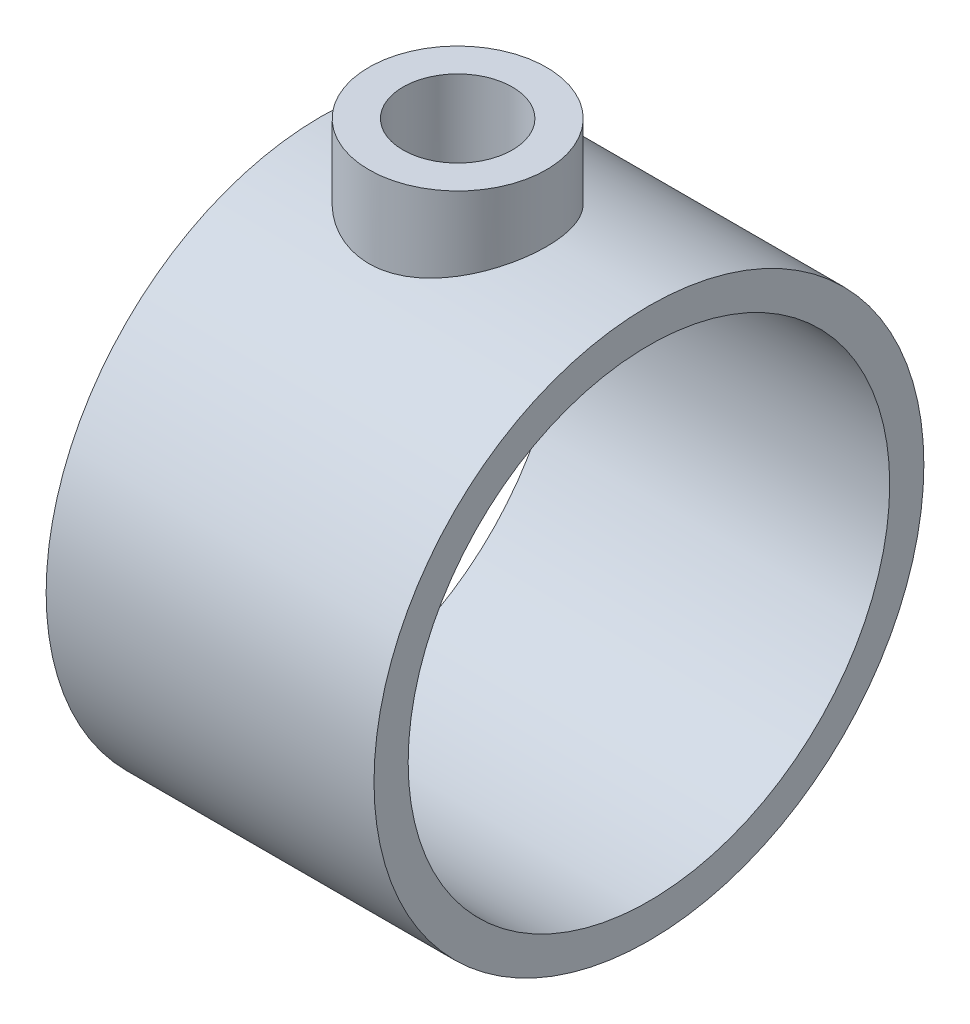
ISO-10303-21;
HEADER;
FILE_DESCRIPTION(('STEP AP214'),'2;1');
FILE_NAME('part.step','',(''),(''),'','','');
FILE_SCHEMA(('AUTOMOTIVE_DESIGN { 1 0 10303 214 1 1 1 1 }'));
ENDSEC;
DATA;
#1=APPLICATION_CONTEXT('core data for automotive mechanical design processes');
#2=APPLICATION_PROTOCOL_DEFINITION('international standard','automotive_design',2000,#1);
#3=PRODUCT_CONTEXT('',#1,'mechanical');
#4=PRODUCT('Part','Part','',(#3));
#5=PRODUCT_RELATED_PRODUCT_CATEGORY('part','',(#4));
#6=PRODUCT_DEFINITION_FORMATION('','',#4);
#7=PRODUCT_DEFINITION_CONTEXT('part definition',#1,'design');
#8=PRODUCT_DEFINITION('design','',#6,#7);
#9=PRODUCT_DEFINITION_SHAPE('','',#8);
#10=(LENGTH_UNIT() NAMED_UNIT(*) SI_UNIT(.MILLI.,.METRE.));
#11=(NAMED_UNIT(*) PLANE_ANGLE_UNIT() SI_UNIT($,.RADIAN.));
#12=(NAMED_UNIT(*) SI_UNIT($,.STERADIAN.) SOLID_ANGLE_UNIT());
#13=UNCERTAINTY_MEASURE_WITH_UNIT(LENGTH_MEASURE(1.E-05),#10,'distance_accuracy_value','');
#14=(GEOMETRIC_REPRESENTATION_CONTEXT(3) GLOBAL_UNCERTAINTY_ASSIGNED_CONTEXT((#13)) GLOBAL_UNIT_ASSIGNED_CONTEXT((#10,
#11,#12)) REPRESENTATION_CONTEXT('',''));
#15=CARTESIAN_POINT('',(0.,0.,0.));
#16=DIRECTION('',(0.,0.,1.));
#17=DIRECTION('',(1.,0.,0.));
#18=AXIS2_PLACEMENT_3D('',#15,#16,#17);
#19=CARTESIAN_POINT('',(3.38094128826442,4.025,0.));
#20=DIRECTION('',(1.,0.,0.));
#21=DIRECTION('',(0.,0.,-1.));
#22=AXIS2_PLACEMENT_3D('',#19,#20,#21);
#23=PLANE('',#22);
#24=CARTESIAN_POINT('',(3.38094128826442,0.,0.));
#25=DIRECTION('',(-1.,0.,0.));
#26=DIRECTION('',(0.,0.,1.));
#27=AXIS2_PLACEMENT_3D('',#24,#25,#26);
#28=CIRCLE('',#27,3.525);
#29=CARTESIAN_POINT('',(3.38094128826442,0.,3.525));
#30=VERTEX_POINT('',#29);
#31=EDGE_CURVE('E10',#30,#30,#28,.T.);
#32=ORIENTED_EDGE('',*,*,#31,.F.);
#33=EDGE_LOOP('',(#32));
#34=FACE_BOUND('',#33,.T.);
#35=CARTESIAN_POINT('',(3.38094128826442,0.,0.));
#36=DIRECTION('',(-1.,0.,0.));
#37=DIRECTION('',(0.,0.,1.));
#38=AXIS2_PLACEMENT_3D('',#35,#36,#37);
#39=CIRCLE('',#38,4.025);
#40=CARTESIAN_POINT('',(3.38094128826442,0.,4.025));
#41=VERTEX_POINT('',#40);
#42=EDGE_CURVE('E62',#41,#41,#39,.T.);
#43=ORIENTED_EDGE('',*,*,#42,.T.);
#44=EDGE_LOOP('',(#43));
#45=FACE_BOUND('',#44,.T.);
#46=ADVANCED_FACE('F36',(#34,#45),#23,.F.);
#47=CARTESIAN_POINT('',(0.,0.,0.));
#48=DIRECTION('',(-1.,0.,0.));
#49=DIRECTION('',(0.,0.,1.));
#50=AXIS2_PLACEMENT_3D('',#47,#48,#49);
#51=CYLINDRICAL_SURFACE('',#50,3.525);
#52=CARTESIAN_POINT('',(5.38094128826442,3.43301980769118,0.800000000000001));
#53=CARTESIAN_POINT('',(5.42525226088804,3.43302070048923,0.799998535829775));
#54=CARTESIAN_POINT('',(5.46958046197013,3.4338870608432,0.796305981011158));
#55=CARTESIAN_POINT('',(5.55697316237242,3.43725191148704,0.781651318657211));
#56=CARTESIAN_POINT('',(5.60003677190309,3.43975152350915,0.770684214816257));
#57=CARTESIAN_POINT('',(5.683623526805,3.44608553469889,0.741846119278411));
#58=CARTESIAN_POINT('',(5.72414952053777,3.44991840446084,0.723983035525875));
#59=CARTESIAN_POINT('',(5.80163126329277,3.45848520791049,0.681883077899317));
#60=CARTESIAN_POINT('',(5.83858702835545,3.46321913754959,0.657646232663392));
#61=CARTESIAN_POINT('',(5.90855115573315,3.47315082339766,0.603017045189949));
#62=CARTESIAN_POINT('',(5.94148516159075,3.47835489392696,0.572530604842659));
#63=CARTESIAN_POINT('',(6.00181871285318,3.48858534433158,0.506470654130731));
#64=CARTESIAN_POINT('',(6.02921780726854,3.49361170969984,0.470896729636411));
#65=CARTESIAN_POINT('',(6.0780004511039,3.50298946387944,0.395170329775834));
#66=CARTESIAN_POINT('',(6.0993120955657,3.50733253243985,0.35497041439999));
#67=CARTESIAN_POINT('',(6.13484910192897,3.51478284247769,0.271444513908556));
#68=CARTESIAN_POINT('',(6.14907532113002,3.51789023345651,0.228118907711874));
#69=CARTESIAN_POINT('',(6.16980269607263,3.5224744443327,0.140345179686971));
#70=CARTESIAN_POINT('',(6.17642981077126,3.52397782145897,0.0959282130728256));
#71=CARTESIAN_POINT('',(6.18216506865104,3.52527676171206,0.00658920940932185));
#72=CARTESIAN_POINT('',(6.18127413511958,3.52507253454887,-0.0383327649436317));
#73=CARTESIAN_POINT('',(6.17209159290147,3.52299944161139,-0.126536975405737));
#74=CARTESIAN_POINT('',(6.16393579787803,3.52116112577534,-0.169834174750001));
#75=CARTESIAN_POINT('',(6.14067193887226,3.51606140305558,-0.254428809790084));
#76=CARTESIAN_POINT('',(6.12556354521606,3.51279992868983,-0.295726150555252));
#77=CARTESIAN_POINT('',(6.08870583387539,3.50517181723292,-0.37552096879833));
#78=CARTESIAN_POINT('',(6.06690583192294,3.50079679052039,-0.413994200018452));
#79=CARTESIAN_POINT('',(6.01732167226206,3.49142003309992,-0.486785402591689));
#80=CARTESIAN_POINT('',(5.98953664147233,3.48641821100118,-0.521102766554873));
#81=CARTESIAN_POINT('',(5.92803449403406,3.47620454818785,-0.585416511171456));
#82=CARTESIAN_POINT('',(5.8941985373717,3.47099051248081,-0.615299004288452));
#83=CARTESIAN_POINT('',(5.82194137306676,3.4610443302105,-0.668987934320014));
#84=CARTESIAN_POINT('',(5.78352002113092,3.45631219882048,-0.692794179953165));
#85=CARTESIAN_POINT('',(5.70298884001895,3.44785923963272,-0.733710908704646));
#86=CARTESIAN_POINT('',(5.66086694231039,3.44414189640416,-0.750798407328598));
#87=CARTESIAN_POINT('',(5.57424481575524,3.43818662400077,-0.777617158550928));
#88=CARTESIAN_POINT('',(5.52974499780708,3.43594844011882,-0.787349677697718));
#89=CARTESIAN_POINT('',(5.44067477156119,3.43325724770042,-0.799002496436104));
#90=CARTESIAN_POINT('',(5.39612726545363,3.4327662058336,-0.801089265929088));
#91=CARTESIAN_POINT('',(5.30732086639102,3.43352206309775,-0.797843320428311));
#92=CARTESIAN_POINT('',(5.26306195220453,3.43476883289645,-0.792511157570018));
#93=CARTESIAN_POINT('',(5.17667825746427,3.43882378263148,-0.774723544233684));
#94=CARTESIAN_POINT('',(5.1345332832723,3.44161156716692,-0.76236107987514));
#95=CARTESIAN_POINT('',(5.05291303430534,3.44841579254659,-0.730965068193404));
#96=CARTESIAN_POINT('',(5.01343803142945,3.45243235829559,-0.71193084266157));
#97=CARTESIAN_POINT('',(4.93756163869414,3.46132426480786,-0.667369498490686));
#98=CARTESIAN_POINT('',(4.90122159238787,3.46621266223772,-0.64174058754597));
#99=CARTESIAN_POINT('',(4.83329692276114,3.47626361892882,-0.58484943585927));
#100=CARTESIAN_POINT('',(4.80171293860906,3.4814262149138,-0.553586439189094));
#101=CARTESIAN_POINT('',(4.74354376245764,3.49157013650939,-0.485558528212208));
#102=CARTESIAN_POINT('',(4.71707249110259,3.49654569033929,-0.448695192873638));
#103=CARTESIAN_POINT('',(4.67069797573317,3.50564568741497,-0.370948577328976));
#104=CARTESIAN_POINT('',(4.6507944132866,3.50977017192082,-0.330065492143305));
#105=CARTESIAN_POINT('',(4.6182754348628,3.51667913399352,-0.245703780043602));
#106=CARTESIAN_POINT('',(4.60561195024212,3.51947242852567,-0.202244437403343));
#107=CARTESIAN_POINT('',(4.58778371725046,3.52344253506629,-0.113744195948554));
#108=CARTESIAN_POINT('',(4.5826177904489,3.52461960110432,-0.0687035468163044));
#109=CARTESIAN_POINT('',(4.57998767849321,3.52521637204167,0.0206022435992021));
#110=CARTESIAN_POINT('',(4.58235392569866,3.52467476923431,0.0648622163104542));
#111=CARTESIAN_POINT('',(4.59433942486687,3.52197868344567,0.152336121374991));
#112=CARTESIAN_POINT('',(4.6039585265251,3.51982423388824,0.195550075386292));
#113=CARTESIAN_POINT('',(4.63009284597119,3.51414819826678,0.27956236981045));
#114=CARTESIAN_POINT('',(4.64658233106718,3.51063171705042,0.320369082069797));
#115=CARTESIAN_POINT('',(4.68596486896619,3.50260573930861,0.39865830378733));
#116=CARTESIAN_POINT('',(4.70885859347171,3.49809613863134,0.436140464009643));
#117=CARTESIAN_POINT('',(4.76094369695042,3.48846032847204,0.507538146439352));
#118=CARTESIAN_POINT('',(4.79025330433113,3.48332347470795,0.541365990143556));
#119=CARTESIAN_POINT('',(4.85410190058549,3.47306692745816,0.603680984366556));
#120=CARTESIAN_POINT('',(4.88864216177991,3.46794723845822,0.632166831697438));
#121=CARTESIAN_POINT('',(4.96258012830731,3.45822067212617,0.683393229037285));
#122=CARTESIAN_POINT('',(5.00204155202376,3.45362240110551,0.706043548160451));
#123=CARTESIAN_POINT('',(5.0843080134885,3.44556920752355,0.744354726662013));
#124=CARTESIAN_POINT('',(5.12711028479476,3.44211335112668,0.760021298382743));
#125=CARTESIAN_POINT('',(5.20509751666653,3.43735091216163,0.781237850557973));
#126=CARTESIAN_POINT('',(5.23987079966471,3.43573787556822,0.788259720605653));
#127=CARTESIAN_POINT('',(5.31007283579883,3.43357199629522,0.797641248962455));
#128=CARTESIAN_POINT('',(5.34550155173691,3.43301909363492,0.80000117103742));
#129=CARTESIAN_POINT('',(5.38094128826442,3.43301980769118,0.800000000000001));
#130=B_SPLINE_CURVE_WITH_KNOTS('',3,(#52,#53,#54,#55,#56,#57,#58,#59,#60,#61,#62,#63,#64,#65,
#66,#67,#68,#69,#70,#71,#72,#73,#74,#75,#76,#77,#78,#79,#80,#81,#82,#83,#84,#85,#86,#87,#88,#89,
#90,#91,#92,#93,#94,#95,#96,#97,#98,#99,#100,#101,#102,#103,#104,#105,#106,#107,#108,#109,#110,
#111,#112,#113,#114,#115,#116,#117,#118,#119,#120,#121,#122,#123,#124,#125,#126,#127,#128,#129),
.UNSPECIFIED.,.T.,.F.,(4,2,2,2,2,2,2,2,2,2,2,2,2,2,2,2,2,2,2,2,2,2,2,2,2,2,2,2,2,2,2,2,2,2,2,2,
2,2,4),(0.,0.132802971896274,0.265697250103318,0.398439582727555,0.531181318934289,
0.666091768510715,0.801013206279901,0.93746801265202,1.07390630468965,1.20804879781222,
1.34217481720859,1.47384483382783,1.60552109453474,1.73822040632101,1.8709390890823,
2.00662791589844,2.14232101369772,2.27847435401467,2.41460424299271,2.54775196388036,
2.6808897761122,2.81230628963974,2.94373616600707,3.07733108672317,3.2109439453017,
3.34725700824648,3.48356346114665,3.6189541072403,3.75432347096919,3.88666707191368,
4.01900793031078,4.15085750586548,4.28272091552492,4.41725673881027,4.55182533973534,
4.68836431894281,4.82479141051397,4.93101269984132,5.03722797915944),.UNSPECIFIED.);
#131=CARTESIAN_POINT('',(5.38094128826442,3.43301980769118,0.800000000000001));
#132=VERTEX_POINT('',#131);
#133=EDGE_CURVE('E81',#132,#132,#130,.T.);
#134=ORIENTED_EDGE('',*,*,#133,.T.);
#135=EDGE_LOOP('',(#134));
#136=FACE_BOUND('',#135,.T.);
#137=CARTESIAN_POINT('',(8.18094128826442,0.,0.));
#138=DIRECTION('',(-1.,0.,0.));
#139=DIRECTION('',(0.,0.,1.));
#140=AXIS2_PLACEMENT_3D('',#137,#138,#139);
#141=CIRCLE('',#140,3.525);
#142=CARTESIAN_POINT('',(8.18094128826442,0.,3.525));
#143=VERTEX_POINT('',#142);
#144=EDGE_CURVE('E44',#143,#143,#141,.T.);
#145=ORIENTED_EDGE('',*,*,#144,.F.);
#146=EDGE_LOOP('',(#145));
#147=FACE_BOUND('',#146,.T.);
#148=ORIENTED_EDGE('',*,*,#31,.T.);
#149=EDGE_LOOP('',(#148));
#150=FACE_BOUND('',#149,.T.);
#151=ADVANCED_FACE('F89',(#136,#147,#150),#51,.F.);
#152=CARTESIAN_POINT('',(8.18094128826442,4.025,0.));
#153=DIRECTION('',(-1.,0.,0.));
#154=DIRECTION('',(0.,0.,1.));
#155=AXIS2_PLACEMENT_3D('',#152,#153,#154);
#156=PLANE('',#155);
#157=CARTESIAN_POINT('',(8.18094128826442,0.,0.));
#158=DIRECTION('',(-1.,0.,0.));
#159=DIRECTION('',(0.,0.,1.));
#160=AXIS2_PLACEMENT_3D('',#157,#158,#159);
#161=CIRCLE('',#160,4.025);
#162=CARTESIAN_POINT('',(8.18094128826442,0.,4.025));
#163=VERTEX_POINT('',#162);
#164=EDGE_CURVE('E52',#163,#163,#161,.T.);
#165=ORIENTED_EDGE('',*,*,#164,.F.);
#166=EDGE_LOOP('',(#165));
#167=FACE_BOUND('',#166,.T.);
#168=ORIENTED_EDGE('',*,*,#144,.T.);
#169=EDGE_LOOP('',(#168));
#170=FACE_BOUND('',#169,.T.);
#171=ADVANCED_FACE('F92',(#167,#170),#156,.F.);
#172=CARTESIAN_POINT('',(0.,0.,0.));
#173=DIRECTION('',(-1.,0.,0.));
#174=DIRECTION('',(0.,0.,1.));
#175=AXIS2_PLACEMENT_3D('',#172,#173,#174);
#176=CYLINDRICAL_SURFACE('',#175,4.025);
#177=CARTESIAN_POINT('',(5.38094128826442,3.80928142830114,1.3));
#178=CARTESIAN_POINT('',(5.30999499931212,3.80928155817652,1.2999999065255));
#179=CARTESIAN_POINT('',(5.23904723248018,3.81128512188264,1.29417257853055));
#180=CARTESIAN_POINT('',(5.09924477149492,3.81904442346279,1.27108979164173));
#181=CARTESIAN_POINT('',(5.03039053463602,3.82480097503466,1.25383185442632));
#182=CARTESIAN_POINT('',(4.89682156511205,3.83934769367404,1.20855016415119));
#183=CARTESIAN_POINT('',(4.83209938043363,3.84813220558293,1.18054646940146));
#184=CARTESIAN_POINT('',(4.70825226690727,3.86773701370522,1.11463591771235));
#185=CARTESIAN_POINT('',(4.64912845504361,3.87855771489684,1.07672709015467));
#186=CARTESIAN_POINT('',(4.53598582565922,3.90146122296498,0.990591739265666));
#187=CARTESIAN_POINT('',(4.48220265081155,3.91357406405527,0.942063600520636));
#188=CARTESIAN_POINT('',(4.38337869260254,3.93744232653778,0.836711717942115));
#189=CARTESIAN_POINT('',(4.33833921859399,3.94919769417709,0.779886733900486));
#190=CARTESIAN_POINT('',(4.25722681467214,3.97137212737273,0.657846071873002));
#191=CARTESIAN_POINT('',(4.22139865448383,3.98175173022207,0.592459909669082));
#192=CARTESIAN_POINT('',(4.16134142580492,3.9996528467338,0.45619684278843));
#193=CARTESIAN_POINT('',(4.13710943387842,4.0071750806505,0.385321327237976));
#194=CARTESIAN_POINT('',(4.10172527881787,4.0183012463091,0.242560431206841));
#195=CARTESIAN_POINT('',(4.09016990523421,4.0220256836792,0.170784554004079));
#196=CARTESIAN_POINT('',(4.07918722062102,4.02556328528735,0.0262225244820574));
#197=CARTESIAN_POINT('',(4.07975697012544,4.02537739749678,-0.0465633787030325));
#198=CARTESIAN_POINT('',(4.09274781454494,4.02119808908508,-0.188233510401645));
#199=CARTESIAN_POINT('',(4.10473139391571,4.0173452348284,-0.257162675577185));
#200=CARTESIAN_POINT('',(4.13948905436697,4.00643956990794,-0.391973217876555));
#201=CARTESIAN_POINT('',(4.1622638540474,3.99938654614245,-0.457854391710353));
#202=CARTESIAN_POINT('',(4.21822573407819,3.98268915631928,-0.585682020709385));
#203=CARTESIAN_POINT('',(4.25154145991183,3.97301299747001,-0.647567831709774));
#204=CARTESIAN_POINT('',(4.32753491962085,3.95208276822295,-0.765003266633233));
#205=CARTESIAN_POINT('',(4.37021514113763,3.94082827883505,-0.820551200953122));
#206=CARTESIAN_POINT('',(4.46595191166414,3.91734431762768,-0.926340103260619));
#207=CARTESIAN_POINT('',(4.51938480442999,3.90509374241011,-0.976236289894902));
#208=CARTESIAN_POINT('',(4.63396942486521,3.88142431416325,-1.0664669573497));
#209=CARTESIAN_POINT('',(4.69512219393618,3.87000557367578,-1.10680014601709));
#210=CARTESIAN_POINT('',(4.82444321749391,3.84918165695417,-1.17719829052759));
#211=CARTESIAN_POINT('',(4.89269048402111,3.83980380144831,-1.20712679170946));
#212=CARTESIAN_POINT('',(5.03363355827129,3.82444163271234,-1.25495402331476));
#213=CARTESIAN_POINT('',(5.10632762511509,3.81845600076114,-1.27285742897536));
#214=CARTESIAN_POINT('',(5.25077918840138,3.81085153830247,-1.29544291580281));
#215=CARTESIAN_POINT('',(5.32244442301163,3.80905737045469,-1.30065626292559));
#216=CARTESIAN_POINT('',(5.46563359424002,3.80955052076905,-1.29921177209264));
#217=CARTESIAN_POINT('',(5.53715755253666,3.81183715457614,-1.29255592461444));
#218=CARTESIAN_POINT('',(5.67568309871425,3.82006030494571,-1.26803808858044));
#219=CARTESIAN_POINT('',(5.74275617236575,3.82587934059296,-1.25053643527685));
#220=CARTESIAN_POINT('',(5.87300332485234,3.84038479519492,-1.20525146375496));
#221=CARTESIAN_POINT('',(5.93617673762958,3.84907170237936,-1.1774663947786));
#222=CARTESIAN_POINT('',(6.05894509262841,3.86865953749115,-1.1114471650739));
#223=CARTESIAN_POINT('',(6.1183742452557,3.87961942958969,-1.07292266058766));
#224=CARTESIAN_POINT('',(6.2301172397644,3.90240009142152,-0.986852126354448));
#225=CARTESIAN_POINT('',(6.28242910191134,3.91422109928321,-0.939303595270721));
#226=CARTESIAN_POINT('',(6.38086813575041,3.93803163607783,-0.83400744849429));
#227=CARTESIAN_POINT('',(6.42661411221253,3.95000506081669,-0.775898821833884));
#228=CARTESIAN_POINT('',(6.50772549010905,3.97224648339172,-0.652537550996354));
#229=CARTESIAN_POINT('',(6.54309132003559,3.98251455161735,-0.587285201864589));
#230=CARTESIAN_POINT('',(6.60210519486687,4.00013446568057,-0.451856257683009));
#231=CARTESIAN_POINT('',(6.62583444032507,4.00750644648671,-0.381717803101932));
#232=CARTESIAN_POINT('',(6.66107241604204,4.01859146080702,-0.238163144407713));
#233=CARTESIAN_POINT('',(6.67258525934175,4.02230572577742,-0.164748052159429));
#234=CARTESIAN_POINT('',(6.68271143067182,4.02556955654697,-0.0202217641559213));
#235=CARTESIAN_POINT('',(6.68187363861866,4.02529633745771,0.0508474089077169));
#236=CARTESIAN_POINT('',(6.66866286083546,4.02104625609214,0.191785786348797));
#237=CARTESIAN_POINT('',(6.6562907163171,4.01706966390651,0.261655077856337));
#238=CARTESIAN_POINT('',(6.62071954114732,4.00592024662108,0.397233136307753));
#239=CARTESIAN_POINT('',(6.5976760370027,3.99879339968562,0.462986755739509));
#240=CARTESIAN_POINT('',(6.54155835421075,3.98207758362545,0.589723247083566));
#241=CARTESIAN_POINT('',(6.50848240358952,3.97248817959922,0.650705273821083));
#242=CARTESIAN_POINT('',(6.4318847701842,3.95141828640955,0.768523696812442));
#243=CARTESIAN_POINT('',(6.38803415706184,3.93988278003854,0.825136289473496));
#244=CARTESIAN_POINT('',(6.29170176328685,3.91636705372066,0.930380316275929));
#245=CARTESIAN_POINT('',(6.2392173150671,3.90438669721849,0.979009274433371));
#246=CARTESIAN_POINT('',(6.12483973794247,3.88082104049924,1.06868295630376));
#247=CARTESIAN_POINT('',(6.06267544048181,3.86926559533059,1.10939068628264));
#248=CARTESIAN_POINT('',(5.93203383550312,3.84839996299475,1.17974415724678));
#249=CARTESIAN_POINT('',(5.86355865359272,3.8390890236345,1.20939360598136));
#250=CARTESIAN_POINT('',(5.72683099761889,3.82438946145605,1.25507383502061));
#251=CARTESIAN_POINT('',(5.65885719831491,3.81878403192261,1.27186886272419));
#252=CARTESIAN_POINT('',(5.52090277979418,3.8112304855933,1.29433036551618));
#253=CARTESIAN_POINT('',(5.45092275300757,3.80928130019199,1.30000009220331));
#254=CARTESIAN_POINT('',(5.38094128826442,3.80928142830114,1.3));
#255=B_SPLINE_CURVE_WITH_KNOTS('',3,(#177,#178,#179,#180,#181,#182,#183,#184,#185,#186,#187,
#188,#189,#190,#191,#192,#193,#194,#195,#196,#197,#198,#199,#200,#201,#202,#203,#204,#205,#206,
#207,#208,#209,#210,#211,#212,#213,#214,#215,#216,#217,#218,#219,#220,#221,#222,#223,#224,#225,
#226,#227,#228,#229,#230,#231,#232,#233,#234,#235,#236,#237,#238,#239,#240,#241,#242,#243,#244,
#245,#246,#247,#248,#249,#250,#251,#252,#253,#254),.UNSPECIFIED.,.T.,.F.,(4,2,2,2,2,2,2,2,2,2,2,
2,2,2,2,2,2,2,2,2,2,2,2,2,2,2,2,2,2,2,2,2,2,2,2,2,2,2,4),(0.,0.212580040952235,
0.425206187428605,0.637437356062802,0.849710780111437,1.06905489402748,1.28843182901917,
1.51314527369535,1.73780203741708,1.95508494010194,2.17231516798647,2.38154010050719,
2.59077896751847,2.80267693136264,3.01463125336557,3.2359890404995,3.45737672049336,
3.68156705884951,3.90567018370692,4.12021639946781,4.33472663896625,4.54246619743384,
4.75024113997453,4.96429378265349,5.17840584468381,5.40209296875532,5.62577085773017,
5.84786487997807,6.06988410344985,6.28206740379183,6.49423523060738,6.70340375123313,
6.91260923763822,7.12923611476482,7.34593004851507,7.57044329582192,7.79488119789447,
8.00463159910416,8.2143206872959),.UNSPECIFIED.);
#256=CARTESIAN_POINT('',(5.38094128826442,3.80928142830114,1.3));
#257=VERTEX_POINT('',#256);
#258=EDGE_CURVE('E55',#257,#257,#255,.T.);
#259=ORIENTED_EDGE('',*,*,#258,.T.);
#260=EDGE_LOOP('',(#259));
#261=FACE_BOUND('',#260,.T.);
#262=ORIENTED_EDGE('',*,*,#42,.F.);
#263=EDGE_LOOP('',(#262));
#264=FACE_BOUND('',#263,.T.);
#265=ORIENTED_EDGE('',*,*,#164,.T.);
#266=EDGE_LOOP('',(#265));
#267=FACE_BOUND('',#266,.T.);
#268=ADVANCED_FACE('F64',(#261,#264,#267),#176,.T.);
#269=CARTESIAN_POINT('',(5.38094128826442,3.7,0.));
#270=DIRECTION('',(0.,1.,0.));
#271=DIRECTION('',(0.,0.,1.));
#272=AXIS2_PLACEMENT_3D('',#269,#270,#271);
#273=CYLINDRICAL_SURFACE('',#272,1.3);
#274=CARTESIAN_POINT('',(5.38094128826442,5.,0.));
#275=DIRECTION('',(0.,1.,0.));
#276=DIRECTION('',(0.,0.,1.));
#277=AXIS2_PLACEMENT_3D('',#274,#275,#276);
#278=CIRCLE('',#277,1.3);
#279=CARTESIAN_POINT('',(5.38094128826442,5.,1.3));
#280=VERTEX_POINT('',#279);
#281=EDGE_CURVE('E63',#280,#280,#278,.T.);
#282=ORIENTED_EDGE('',*,*,#281,.F.);
#283=EDGE_LOOP('',(#282));
#284=FACE_BOUND('',#283,.T.);
#285=ORIENTED_EDGE('',*,*,#258,.F.);
#286=EDGE_LOOP('',(#285));
#287=FACE_BOUND('',#286,.T.);
#288=ADVANCED_FACE('F67',(#284,#287),#273,.T.);
#289=CARTESIAN_POINT('',(5.38094128826442,5.,0.));
#290=DIRECTION('',(0.,1.,0.));
#291=DIRECTION('',(0.,0.,1.));
#292=AXIS2_PLACEMENT_3D('',#289,#290,#291);
#293=PLANE('',#292);
#294=CARTESIAN_POINT('',(5.38094128826442,5.,0.));
#295=DIRECTION('',(0.,1.,0.));
#296=DIRECTION('',(0.,0.,1.));
#297=AXIS2_PLACEMENT_3D('',#294,#295,#296);
#298=CIRCLE('',#297,0.800000000000001);
#299=CARTESIAN_POINT('',(5.38094128826442,5.,0.800000000000001));
#300=VERTEX_POINT('',#299);
#301=EDGE_CURVE('E39',#300,#300,#298,.T.);
#302=ORIENTED_EDGE('',*,*,#301,.F.);
#303=EDGE_LOOP('',(#302));
#304=FACE_BOUND('',#303,.T.);
#305=ORIENTED_EDGE('',*,*,#281,.T.);
#306=EDGE_LOOP('',(#305));
#307=FACE_BOUND('',#306,.T.);
#308=ADVANCED_FACE('F71',(#304,#307),#293,.T.);
#309=CARTESIAN_POINT('',(5.38094128826442,-0.650000000000001,0.));
#310=DIRECTION('',(0.,1.,0.));
#311=DIRECTION('',(0.,0.,1.));
#312=AXIS2_PLACEMENT_3D('',#309,#310,#311);
#313=CYLINDRICAL_SURFACE('',#312,0.800000000000001);
#314=ORIENTED_EDGE('',*,*,#301,.T.);
#315=EDGE_LOOP('',(#314));
#316=FACE_BOUND('',#315,.T.);
#317=ORIENTED_EDGE('',*,*,#133,.F.);
#318=EDGE_LOOP('',(#317));
#319=FACE_BOUND('',#318,.T.);
#320=ADVANCED_FACE('F75',(#316,#319),#313,.F.);
#321=CLOSED_SHELL('',(#46,#151,#171,#268,#288,#308,#320));
#322=MANIFOLD_SOLID_BREP('B2',#321);
#323=ADVANCED_BREP_SHAPE_REPRESENTATION('',(#18,#322),#14);
#324=SHAPE_DEFINITION_REPRESENTATION(#9,#323);
ENDSEC;
END-ISO-10303-21;
